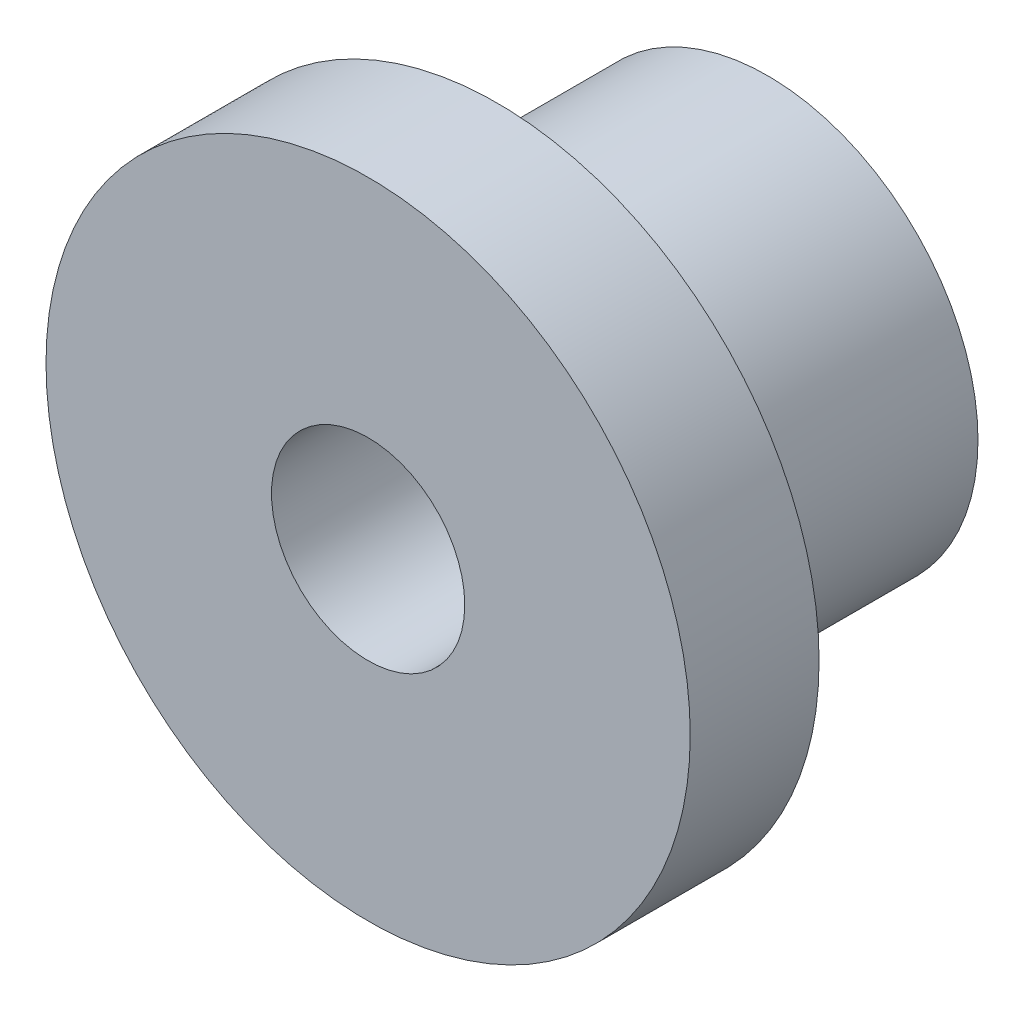
ISO-10303-21;
HEADER;
FILE_DESCRIPTION(('STEP AP214'),'2;1');
FILE_NAME('part.step','',(''),(''),'','','');
FILE_SCHEMA(('AUTOMOTIVE_DESIGN { 1 0 10303 214 1 1 1 1 }'));
ENDSEC;
DATA;
#1=APPLICATION_CONTEXT('core data for automotive mechanical design processes');
#2=APPLICATION_PROTOCOL_DEFINITION('international standard','automotive_design',2000,#1);
#3=PRODUCT_CONTEXT('',#1,'mechanical');
#4=PRODUCT('Part','Part','',(#3));
#5=PRODUCT_RELATED_PRODUCT_CATEGORY('part','',(#4));
#6=PRODUCT_DEFINITION_FORMATION('','',#4);
#7=PRODUCT_DEFINITION_CONTEXT('part definition',#1,'design');
#8=PRODUCT_DEFINITION('design','',#6,#7);
#9=PRODUCT_DEFINITION_SHAPE('','',#8);
#10=(LENGTH_UNIT() NAMED_UNIT(*) SI_UNIT(.MILLI.,.METRE.));
#11=(NAMED_UNIT(*) PLANE_ANGLE_UNIT() SI_UNIT($,.RADIAN.));
#12=(NAMED_UNIT(*) SI_UNIT($,.STERADIAN.) SOLID_ANGLE_UNIT());
#13=UNCERTAINTY_MEASURE_WITH_UNIT(LENGTH_MEASURE(1.E-05),#10,'distance_accuracy_value','');
#14=(GEOMETRIC_REPRESENTATION_CONTEXT(3) GLOBAL_UNCERTAINTY_ASSIGNED_CONTEXT((#13)) GLOBAL_UNIT_ASSIGNED_CONTEXT((#10,
#11,#12)) REPRESENTATION_CONTEXT('',''));
#15=CARTESIAN_POINT('',(0.,0.,0.));
#16=DIRECTION('',(0.,0.,1.));
#17=DIRECTION('',(1.,0.,0.));
#18=AXIS2_PLACEMENT_3D('',#15,#16,#17);
#19=CARTESIAN_POINT('',(0.,0.,-3.15));
#20=DIRECTION('',(0.,0.,1.));
#21=DIRECTION('',(1.,0.,0.));
#22=AXIS2_PLACEMENT_3D('',#19,#20,#21);
#23=PLANE('',#22);
#24=CARTESIAN_POINT('',(0.,0.,-3.15));
#25=DIRECTION('',(0.,0.,1.));
#26=DIRECTION('',(1.,0.,0.));
#27=AXIS2_PLACEMENT_3D('',#24,#25,#26);
#28=CIRCLE('',#27,4.9);
#29=CARTESIAN_POINT('',(4.9,0.,-3.15));
#30=VERTEX_POINT('',#29);
#31=EDGE_CURVE('E35',#30,#30,#28,.T.);
#32=ORIENTED_EDGE('',*,*,#31,.F.);
#33=EDGE_LOOP('',(#32));
#34=FACE_BOUND('',#33,.T.);
#35=CARTESIAN_POINT('',(0.,0.,-3.15));
#36=DIRECTION('',(0.,0.,1.));
#37=DIRECTION('',(1.,0.,0.));
#38=AXIS2_PLACEMENT_3D('',#35,#36,#37);
#39=CIRCLE('',#38,2.25);
#40=CARTESIAN_POINT('',(2.25,0.,-3.15));
#41=VERTEX_POINT('',#40);
#42=EDGE_CURVE('E42',#41,#41,#39,.T.);
#43=ORIENTED_EDGE('',*,*,#42,.T.);
#44=EDGE_LOOP('',(#43));
#45=FACE_BOUND('',#44,.T.);
#46=ADVANCED_FACE('F31',(#34,#45),#23,.F.);
#47=CARTESIAN_POINT('',(0.,0.,3.15));
#48=DIRECTION('',(0.,0.,-1.));
#49=DIRECTION('',(-1.,0.,0.));
#50=AXIS2_PLACEMENT_3D('',#47,#48,#49);
#51=CYLINDRICAL_SURFACE('',#50,4.9);
#52=CARTESIAN_POINT('',(0.,0.,3.15));
#53=DIRECTION('',(0.,0.,1.));
#54=DIRECTION('',(1.,0.,0.));
#55=AXIS2_PLACEMENT_3D('',#52,#53,#54);
#56=CIRCLE('',#55,4.9);
#57=CARTESIAN_POINT('',(4.9,0.,3.15));
#58=VERTEX_POINT('',#57);
#59=EDGE_CURVE('E10',#58,#58,#56,.T.);
#60=ORIENTED_EDGE('',*,*,#59,.F.);
#61=EDGE_LOOP('',(#60));
#62=FACE_BOUND('',#61,.T.);
#63=ORIENTED_EDGE('',*,*,#31,.T.);
#64=EDGE_LOOP('',(#63));
#65=FACE_BOUND('',#64,.T.);
#66=ADVANCED_FACE('F33',(#62,#65),#51,.T.);
#67=CARTESIAN_POINT('',(0.,0.,3.15));
#68=DIRECTION('',(0.,0.,-1.));
#69=DIRECTION('',(-1.,0.,0.));
#70=AXIS2_PLACEMENT_3D('',#67,#68,#69);
#71=CYLINDRICAL_SURFACE('',#70,2.25);
#72=ORIENTED_EDGE('',*,*,#42,.F.);
#73=EDGE_LOOP('',(#72));
#74=FACE_BOUND('',#73,.T.);
#75=CARTESIAN_POINT('',(0.,0.,6.15));
#76=DIRECTION('',(0.,0.,1.));
#77=DIRECTION('',(1.,0.,0.));
#78=AXIS2_PLACEMENT_3D('',#75,#76,#77);
#79=CIRCLE('',#78,2.25);
#80=CARTESIAN_POINT('',(2.25,0.,6.15));
#81=VERTEX_POINT('',#80);
#82=EDGE_CURVE('E50',#81,#81,#79,.T.);
#83=ORIENTED_EDGE('',*,*,#82,.T.);
#84=EDGE_LOOP('',(#83));
#85=FACE_BOUND('',#84,.T.);
#86=ADVANCED_FACE('F56',(#74,#85),#71,.F.);
#87=CARTESIAN_POINT('',(0.,0.,6.15));
#88=DIRECTION('',(0.,0.,1.));
#89=DIRECTION('',(1.,0.,0.));
#90=AXIS2_PLACEMENT_3D('',#87,#88,#89);
#91=PLANE('',#90);
#92=CARTESIAN_POINT('',(0.,0.,6.15));
#93=DIRECTION('',(0.,0.,1.));
#94=DIRECTION('',(1.,0.,0.));
#95=AXIS2_PLACEMENT_3D('',#92,#93,#94);
#96=CIRCLE('',#95,7.5);
#97=CARTESIAN_POINT('',(7.5,0.,6.15));
#98=VERTEX_POINT('',#97);
#99=EDGE_CURVE('E46',#98,#98,#96,.T.);
#100=ORIENTED_EDGE('',*,*,#99,.T.);
#101=EDGE_LOOP('',(#100));
#102=FACE_BOUND('',#101,.T.);
#103=ORIENTED_EDGE('',*,*,#82,.F.);
#104=EDGE_LOOP('',(#103));
#105=FACE_BOUND('',#104,.T.);
#106=ADVANCED_FACE('F58',(#102,#105),#91,.T.);
#107=CARTESIAN_POINT('',(0.,0.,3.15));
#108=DIRECTION('',(0.,0.,1.));
#109=DIRECTION('',(1.,0.,0.));
#110=AXIS2_PLACEMENT_3D('',#107,#108,#109);
#111=PLANE('',#110);
#112=ORIENTED_EDGE('',*,*,#59,.T.);
#113=EDGE_LOOP('',(#112));
#114=FACE_BOUND('',#113,.T.);
#115=CARTESIAN_POINT('',(0.,0.,3.15));
#116=DIRECTION('',(0.,0.,1.));
#117=DIRECTION('',(1.,0.,0.));
#118=AXIS2_PLACEMENT_3D('',#115,#116,#117);
#119=CIRCLE('',#118,7.5);
#120=CARTESIAN_POINT('',(7.5,0.,3.15));
#121=VERTEX_POINT('',#120);
#122=EDGE_CURVE('E47',#121,#121,#119,.T.);
#123=ORIENTED_EDGE('',*,*,#122,.F.);
#124=EDGE_LOOP('',(#123));
#125=FACE_BOUND('',#124,.T.);
#126=ADVANCED_FACE('F60',(#114,#125),#111,.F.);
#127=CARTESIAN_POINT('',(0.,0.,6.15));
#128=DIRECTION('',(0.,0.,-1.));
#129=DIRECTION('',(-1.,0.,0.));
#130=AXIS2_PLACEMENT_3D('',#127,#128,#129);
#131=CYLINDRICAL_SURFACE('',#130,7.5);
#132=ORIENTED_EDGE('',*,*,#99,.F.);
#133=EDGE_LOOP('',(#132));
#134=FACE_BOUND('',#133,.T.);
#135=ORIENTED_EDGE('',*,*,#122,.T.);
#136=EDGE_LOOP('',(#135));
#137=FACE_BOUND('',#136,.T.);
#138=ADVANCED_FACE('F67',(#134,#137),#131,.T.);
#139=CLOSED_SHELL('',(#46,#66,#86,#106,#126,#138));
#140=MANIFOLD_SOLID_BREP('B2',#139);
#141=ADVANCED_BREP_SHAPE_REPRESENTATION('',(#18,#140),#14);
#142=SHAPE_DEFINITION_REPRESENTATION(#9,#141);
ENDSEC;
END-ISO-10303-21;
